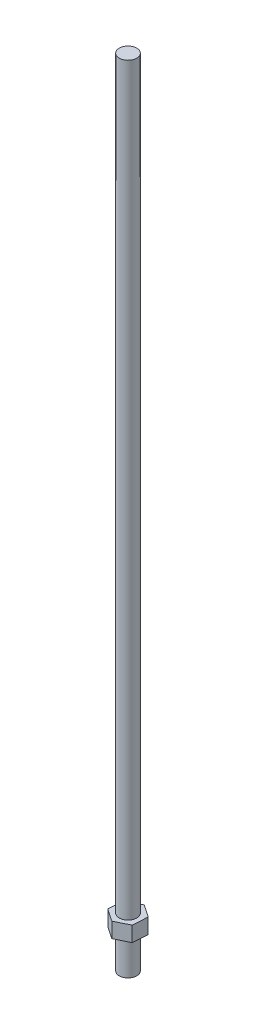
ISO-10303-21;
HEADER;
FILE_DESCRIPTION(('STEP AP214'),'2;1');
FILE_NAME('part.step','',(''),(''),'','','');
FILE_SCHEMA(('AUTOMOTIVE_DESIGN { 1 0 10303 214 1 1 1 1 }'));
ENDSEC;
DATA;
#1=APPLICATION_CONTEXT('core data for automotive mechanical design processes');
#2=APPLICATION_PROTOCOL_DEFINITION('international standard','automotive_design',2000,#1);
#3=PRODUCT_CONTEXT('',#1,'mechanical');
#4=PRODUCT('Part','Part','',(#3));
#5=PRODUCT_RELATED_PRODUCT_CATEGORY('part','',(#4));
#6=PRODUCT_DEFINITION_FORMATION('','',#4);
#7=PRODUCT_DEFINITION_CONTEXT('part definition',#1,'design');
#8=PRODUCT_DEFINITION('design','',#6,#7);
#9=PRODUCT_DEFINITION_SHAPE('','',#8);
#10=(LENGTH_UNIT() NAMED_UNIT(*) SI_UNIT(.MILLI.,.METRE.));
#11=(NAMED_UNIT(*) PLANE_ANGLE_UNIT() SI_UNIT($,.RADIAN.));
#12=(NAMED_UNIT(*) SI_UNIT($,.STERADIAN.) SOLID_ANGLE_UNIT());
#13=UNCERTAINTY_MEASURE_WITH_UNIT(LENGTH_MEASURE(1.E-05),#10,'distance_accuracy_value','');
#14=(GEOMETRIC_REPRESENTATION_CONTEXT(3) GLOBAL_UNCERTAINTY_ASSIGNED_CONTEXT((#13)) GLOBAL_UNIT_ASSIGNED_CONTEXT((#10,
#11,#12)) REPRESENTATION_CONTEXT('',''));
#15=CARTESIAN_POINT('',(0.,0.,0.));
#16=DIRECTION('',(0.,0.,1.));
#17=DIRECTION('',(1.,0.,0.));
#18=AXIS2_PLACEMENT_3D('',#15,#16,#17);
#19=CARTESIAN_POINT('',(0.,577.85,0.));
#20=DIRECTION('',(0.,-1.,0.));
#21=DIRECTION('',(0.,0.,-1.));
#22=AXIS2_PLACEMENT_3D('',#19,#20,#21);
#23=CYLINDRICAL_SURFACE('',#22,6.35);
#24=CARTESIAN_POINT('',(0.,36.449,0.));
#25=DIRECTION('',(0.,1.,0.));
#26=DIRECTION('',(0.,0.,1.));
#27=AXIS2_PLACEMENT_3D('',#24,#25,#26);
#28=CIRCLE('',#27,6.35);
#29=CARTESIAN_POINT('',(0.,36.449,6.35));
#30=VERTEX_POINT('',#29);
#31=EDGE_CURVE('E47',#30,#30,#28,.T.);
#32=ORIENTED_EDGE('',*,*,#31,.T.);
#33=EDGE_LOOP('',(#32));
#34=FACE_BOUND('',#33,.T.);
#35=CARTESIAN_POINT('',(0.,577.85,0.));
#36=DIRECTION('',(0.,1.,0.));
#37=DIRECTION('',(0.,0.,1.));
#38=AXIS2_PLACEMENT_3D('',#35,#36,#37);
#39=CIRCLE('',#38,6.35);
#40=CARTESIAN_POINT('',(0.,577.85,6.35));
#41=VERTEX_POINT('',#40);
#42=EDGE_CURVE('E53',#41,#41,#39,.T.);
#43=ORIENTED_EDGE('',*,*,#42,.F.);
#44=EDGE_LOOP('',(#43));
#45=FACE_BOUND('',#44,.T.);
#46=ADVANCED_FACE('F44',(#34,#45),#23,.T.);
#47=CARTESIAN_POINT('',(0.,577.85,0.));
#48=DIRECTION('',(0.,1.,0.));
#49=DIRECTION('',(0.,0.,1.));
#50=AXIS2_PLACEMENT_3D('',#47,#48,#49);
#51=PLANE('',#50);
#52=ORIENTED_EDGE('',*,*,#42,.T.);
#53=EDGE_LOOP('',(#52));
#54=FACE_BOUND('',#53,.T.);
#55=ADVANCED_FACE('F162',(#54),#51,.T.);
#56=CARTESIAN_POINT('',(0.,36.449,0.));
#57=DIRECTION('',(0.,1.,0.));
#58=DIRECTION('',(0.,0.,1.));
#59=AXIS2_PLACEMENT_3D('',#56,#57,#58);
#60=PLANE('',#59);
#61=DIRECTION('',(0.0679923661634542,0.,-0.99768584140675));
#62=VECTOR('',#61,1.);
#63=CARTESIAN_POINT('',(9.12904985050717,36.449,6.1341624389117));
#64=LINE('',#63,#62);
#65=CARTESIAN_POINT('',(9.12904985050717,36.449,6.1341624389117));
#66=VERTEX_POINT('',#65);
#67=CARTESIAN_POINT('',(9.87686542829142,36.449,-4.83890786349789));
#68=VERTEX_POINT('',#67);
#69=EDGE_CURVE('E141',#66,#68,#64,.T.);
#70=ORIENTED_EDGE('',*,*,#69,.T.);
#71=DIRECTION('',(-0.830025100572571,0.,-0.55772603706434));
#72=VECTOR('',#71,1.);
#73=CARTESIAN_POINT('',(9.87686542829142,36.449,-4.83890786349789));
#74=LINE('',#73,#72);
#75=CARTESIAN_POINT('',(0.747815577784257,36.449,-10.9730703024096));
#76=VERTEX_POINT('',#75);
#77=EDGE_CURVE('E99',#68,#76,#74,.T.);
#78=ORIENTED_EDGE('',*,*,#77,.T.);
#79=DIRECTION('',(-0.898017466736025,0.,0.43995980434241));
#80=VECTOR('',#79,1.);
#81=CARTESIAN_POINT('',(0.747815577784257,36.449,-10.9730703024096));
#82=LINE('',#81,#80);
#83=CARTESIAN_POINT('',(-9.12904985050717,36.449,-6.1341624389117));
#84=VERTEX_POINT('',#83);
#85=EDGE_CURVE('E113',#76,#84,#82,.T.);
#86=ORIENTED_EDGE('',*,*,#85,.T.);
#87=DIRECTION('',(-0.0679923661634545,0.,0.99768584140675));
#88=VECTOR('',#87,1.);
#89=CARTESIAN_POINT('',(-9.12904985050717,36.449,-6.1341624389117));
#90=LINE('',#89,#88);
#91=CARTESIAN_POINT('',(-9.87686542829143,36.449,4.83890786349789));
#92=VERTEX_POINT('',#91);
#93=EDGE_CURVE('E106',#84,#92,#90,.T.);
#94=ORIENTED_EDGE('',*,*,#93,.T.);
#95=DIRECTION('',(0.830025100572571,0.,0.55772603706434));
#96=VECTOR('',#95,1.);
#97=CARTESIAN_POINT('',(-9.87686542829143,36.449,4.83890786349789));
#98=LINE('',#97,#96);
#99=CARTESIAN_POINT('',(-0.747815577784261,36.449,10.9730703024096));
#100=VERTEX_POINT('',#99);
#101=EDGE_CURVE('E111',#92,#100,#98,.T.);
#102=ORIENTED_EDGE('',*,*,#101,.T.);
#103=DIRECTION('',(0.898017466736025,0.,-0.43995980434241));
#104=VECTOR('',#103,1.);
#105=CARTESIAN_POINT('',(-0.747815577784261,36.449,10.9730703024096));
#106=LINE('',#105,#104);
#107=EDGE_CURVE('E61',#100,#66,#106,.T.);
#108=ORIENTED_EDGE('',*,*,#107,.T.);
#109=EDGE_LOOP('',(#70,#78,#86,#94,#102,#108));
#110=FACE_BOUND('',#109,.T.);
#111=ORIENTED_EDGE('',*,*,#31,.F.);
#112=EDGE_LOOP('',(#111));
#113=FACE_BOUND('',#112,.T.);
#114=ADVANCED_FACE('F108',(#110,#113),#60,.T.);
#115=CARTESIAN_POINT('',(0.,25.4,0.));
#116=DIRECTION('',(0.,1.,0.));
#117=DIRECTION('',(0.,0.,1.));
#118=AXIS2_PLACEMENT_3D('',#115,#116,#117);
#119=PLANE('',#118);
#120=DIRECTION('',(0.0679923661634542,0.,-0.99768584140675));
#121=VECTOR('',#120,1.);
#122=CARTESIAN_POINT('',(9.12904985050717,25.4,6.1341624389117));
#123=LINE('',#122,#121);
#124=CARTESIAN_POINT('',(9.12904985050717,25.4,6.1341624389117));
#125=VERTEX_POINT('',#124);
#126=CARTESIAN_POINT('',(9.87686542829142,25.4,-4.83890786349789));
#127=VERTEX_POINT('',#126);
#128=EDGE_CURVE('E131',#125,#127,#123,.T.);
#129=ORIENTED_EDGE('',*,*,#128,.F.);
#130=DIRECTION('',(0.898017466736025,0.,-0.43995980434241));
#131=VECTOR('',#130,1.);
#132=CARTESIAN_POINT('',(-0.747815577784261,25.4,10.9730703024096));
#133=LINE('',#132,#131);
#134=CARTESIAN_POINT('',(-0.747815577784261,25.4,10.9730703024096));
#135=VERTEX_POINT('',#134);
#136=EDGE_CURVE('E90',#135,#125,#133,.T.);
#137=ORIENTED_EDGE('',*,*,#136,.F.);
#138=DIRECTION('',(0.830025100572571,0.,0.55772603706434));
#139=VECTOR('',#138,1.);
#140=CARTESIAN_POINT('',(-9.87686542829143,25.4,4.83890786349789));
#141=LINE('',#140,#139);
#142=CARTESIAN_POINT('',(-9.87686542829143,25.4,4.83890786349789));
#143=VERTEX_POINT('',#142);
#144=EDGE_CURVE('E84',#143,#135,#141,.T.);
#145=ORIENTED_EDGE('',*,*,#144,.F.);
#146=DIRECTION('',(-0.0679923661634545,0.,0.99768584140675));
#147=VECTOR('',#146,1.);
#148=CARTESIAN_POINT('',(-9.12904985050717,25.4,-6.1341624389117));
#149=LINE('',#148,#147);
#150=CARTESIAN_POINT('',(-9.12904985050717,25.4,-6.1341624389117));
#151=VERTEX_POINT('',#150);
#152=EDGE_CURVE('E121',#151,#143,#149,.T.);
#153=ORIENTED_EDGE('',*,*,#152,.F.);
#154=DIRECTION('',(-0.898017466736025,0.,0.43995980434241));
#155=VECTOR('',#154,1.);
#156=CARTESIAN_POINT('',(0.747815577784257,25.4,-10.9730703024096));
#157=LINE('',#156,#155);
#158=CARTESIAN_POINT('',(0.747815577784257,25.4,-10.9730703024096));
#159=VERTEX_POINT('',#158);
#160=EDGE_CURVE('E136',#159,#151,#157,.T.);
#161=ORIENTED_EDGE('',*,*,#160,.F.);
#162=DIRECTION('',(-0.830025100572571,0.,-0.55772603706434));
#163=VECTOR('',#162,1.);
#164=CARTESIAN_POINT('',(9.87686542829142,25.4,-4.83890786349789));
#165=LINE('',#164,#163);
#166=EDGE_CURVE('E134',#127,#159,#165,.T.);
#167=ORIENTED_EDGE('',*,*,#166,.F.);
#168=EDGE_LOOP('',(#129,#137,#145,#153,#161,#167));
#169=FACE_BOUND('',#168,.T.);
#170=CARTESIAN_POINT('',(0.,25.4,0.));
#171=DIRECTION('',(0.,1.,0.));
#172=DIRECTION('',(0.,0.,1.));
#173=AXIS2_PLACEMENT_3D('',#170,#171,#172);
#174=CIRCLE('',#173,6.35);
#175=CARTESIAN_POINT('',(0.,25.4,6.35));
#176=VERTEX_POINT('',#175);
#177=EDGE_CURVE('E13',#176,#176,#174,.T.);
#178=ORIENTED_EDGE('',*,*,#177,.T.);
#179=EDGE_LOOP('',(#178));
#180=FACE_BOUND('',#179,.T.);
#181=ADVANCED_FACE('F161',(#169,#180),#119,.F.);
#182=CARTESIAN_POINT('',(9.12904985050717,36.449,6.1341624389117));
#183=DIRECTION('',(-0.99768584140675,0.,-0.0679923661634542));
#184=DIRECTION('',(-0.0679923661634542,0.,0.99768584140675));
#185=AXIS2_PLACEMENT_3D('',#182,#183,#184);
#186=PLANE('',#185);
#187=ORIENTED_EDGE('',*,*,#128,.T.);
#188=DIRECTION('',(0.,-1.,0.));
#189=VECTOR('',#188,1.);
#190=CARTESIAN_POINT('',(9.87686542829142,36.449,-4.83890786349789));
#191=LINE('',#190,#189);
#192=EDGE_CURVE('E148',#68,#127,#191,.T.);
#193=ORIENTED_EDGE('',*,*,#192,.F.);
#194=ORIENTED_EDGE('',*,*,#69,.F.);
#195=DIRECTION('',(0.,-1.,0.));
#196=VECTOR('',#195,1.);
#197=CARTESIAN_POINT('',(9.12904985050717,36.449,6.1341624389117));
#198=LINE('',#197,#196);
#199=EDGE_CURVE('E127',#66,#125,#198,.T.);
#200=ORIENTED_EDGE('',*,*,#199,.T.);
#201=EDGE_LOOP('',(#187,#193,#194,#200));
#202=FACE_BOUND('',#201,.T.);
#203=ADVANCED_FACE('F168',(#202),#186,.F.);
#204=CARTESIAN_POINT('',(9.87686542829142,36.449,-4.83890786349789));
#205=DIRECTION('',(-0.55772603706434,0.,0.830025100572571));
#206=DIRECTION('',(0.830025100572571,0.,0.55772603706434));
#207=AXIS2_PLACEMENT_3D('',#204,#205,#206);
#208=PLANE('',#207);
#209=ORIENTED_EDGE('',*,*,#166,.T.);
#210=DIRECTION('',(0.,-1.,0.));
#211=VECTOR('',#210,1.);
#212=CARTESIAN_POINT('',(0.747815577784257,36.449,-10.9730703024096));
#213=LINE('',#212,#211);
#214=EDGE_CURVE('E145',#76,#159,#213,.T.);
#215=ORIENTED_EDGE('',*,*,#214,.F.);
#216=ORIENTED_EDGE('',*,*,#77,.F.);
#217=ORIENTED_EDGE('',*,*,#192,.T.);
#218=EDGE_LOOP('',(#209,#215,#216,#217));
#219=FACE_BOUND('',#218,.T.);
#220=ADVANCED_FACE('F194',(#219),#208,.F.);
#221=CARTESIAN_POINT('',(0.747815577784257,36.449,-10.9730703024096));
#222=DIRECTION('',(0.43995980434241,0.,0.898017466736025));
#223=DIRECTION('',(0.898017466736025,0.,-0.43995980434241));
#224=AXIS2_PLACEMENT_3D('',#221,#222,#223);
#225=PLANE('',#224);
#226=ORIENTED_EDGE('',*,*,#160,.T.);
#227=DIRECTION('',(0.,-1.,0.));
#228=VECTOR('',#227,1.);
#229=CARTESIAN_POINT('',(-9.12904985050717,36.449,-6.1341624389117));
#230=LINE('',#229,#228);
#231=EDGE_CURVE('E122',#84,#151,#230,.T.);
#232=ORIENTED_EDGE('',*,*,#231,.F.);
#233=ORIENTED_EDGE('',*,*,#85,.F.);
#234=ORIENTED_EDGE('',*,*,#214,.T.);
#235=EDGE_LOOP('',(#226,#232,#233,#234));
#236=FACE_BOUND('',#235,.T.);
#237=ADVANCED_FACE('F198',(#236),#225,.F.);
#238=CARTESIAN_POINT('',(-9.12904985050717,36.449,-6.1341624389117));
#239=DIRECTION('',(0.99768584140675,0.,0.0679923661634545));
#240=DIRECTION('',(0.0679923661634545,0.,-0.99768584140675));
#241=AXIS2_PLACEMENT_3D('',#238,#239,#240);
#242=PLANE('',#241);
#243=ORIENTED_EDGE('',*,*,#152,.T.);
#244=DIRECTION('',(0.,-1.,0.));
#245=VECTOR('',#244,1.);
#246=CARTESIAN_POINT('',(-9.87686542829143,36.449,4.83890786349789));
#247=LINE('',#246,#245);
#248=EDGE_CURVE('E118',#92,#143,#247,.T.);
#249=ORIENTED_EDGE('',*,*,#248,.F.);
#250=ORIENTED_EDGE('',*,*,#93,.F.);
#251=ORIENTED_EDGE('',*,*,#231,.T.);
#252=EDGE_LOOP('',(#243,#249,#250,#251));
#253=FACE_BOUND('',#252,.T.);
#254=ADVANCED_FACE('F119',(#253),#242,.F.);
#255=CARTESIAN_POINT('',(-9.87686542829143,36.449,4.83890786349789));
#256=DIRECTION('',(0.55772603706434,0.,-0.830025100572571));
#257=DIRECTION('',(-0.830025100572571,0.,-0.55772603706434));
#258=AXIS2_PLACEMENT_3D('',#255,#256,#257);
#259=PLANE('',#258);
#260=ORIENTED_EDGE('',*,*,#144,.T.);
#261=DIRECTION('',(0.,-1.,0.));
#262=VECTOR('',#261,1.);
#263=CARTESIAN_POINT('',(-0.747815577784261,36.449,10.9730703024096));
#264=LINE('',#263,#262);
#265=EDGE_CURVE('E123',#100,#135,#264,.T.);
#266=ORIENTED_EDGE('',*,*,#265,.F.);
#267=ORIENTED_EDGE('',*,*,#101,.F.);
#268=ORIENTED_EDGE('',*,*,#248,.T.);
#269=EDGE_LOOP('',(#260,#266,#267,#268));
#270=FACE_BOUND('',#269,.T.);
#271=ADVANCED_FACE('F125',(#270),#259,.F.);
#272=CARTESIAN_POINT('',(-0.747815577784261,36.449,10.9730703024096));
#273=DIRECTION('',(-0.43995980434241,0.,-0.898017466736025));
#274=DIRECTION('',(-0.898017466736026,0.,0.43995980434241));
#275=AXIS2_PLACEMENT_3D('',#272,#273,#274);
#276=PLANE('',#275);
#277=ORIENTED_EDGE('',*,*,#136,.T.);
#278=ORIENTED_EDGE('',*,*,#199,.F.);
#279=ORIENTED_EDGE('',*,*,#107,.F.);
#280=ORIENTED_EDGE('',*,*,#265,.T.);
#281=EDGE_LOOP('',(#277,#278,#279,#280));
#282=FACE_BOUND('',#281,.T.);
#283=ADVANCED_FACE('F182',(#282),#276,.F.);
#284=CARTESIAN_POINT('',(0.,0.,0.));
#285=DIRECTION('',(0.,1.,0.));
#286=DIRECTION('',(0.,0.,1.));
#287=AXIS2_PLACEMENT_3D('',#284,#285,#286);
#288=PLANE('',#287);
#289=CARTESIAN_POINT('',(0.,0.,0.));
#290=DIRECTION('',(0.,1.,0.));
#291=DIRECTION('',(0.,0.,1.));
#292=AXIS2_PLACEMENT_3D('',#289,#290,#291);
#293=CIRCLE('',#292,6.35);
#294=CARTESIAN_POINT('',(0.,0.,6.35));
#295=VERTEX_POINT('',#294);
#296=EDGE_CURVE('E152',#295,#295,#293,.T.);
#297=ORIENTED_EDGE('',*,*,#296,.F.);
#298=EDGE_LOOP('',(#297));
#299=FACE_BOUND('',#298,.T.);
#300=ADVANCED_FACE('F178',(#299),#288,.F.);
#301=ORIENTED_EDGE('',*,*,#296,.T.);
#302=EDGE_LOOP('',(#301));
#303=FACE_BOUND('',#302,.T.);
#304=ORIENTED_EDGE('',*,*,#177,.F.);
#305=EDGE_LOOP('',(#304));
#306=FACE_BOUND('',#305,.T.);
#307=ADVANCED_FACE('F174',(#303,#306),#23,.T.);
#308=CLOSED_SHELL('',(#46,#55,#114,#181,#203,#220,#237,#254,#271,#283,#300,#307));
#309=MANIFOLD_SOLID_BREP('B2',#308);
#310=ADVANCED_BREP_SHAPE_REPRESENTATION('',(#18,#309),#14);
#311=SHAPE_DEFINITION_REPRESENTATION(#9,#310);
ENDSEC;
END-ISO-10303-21;
